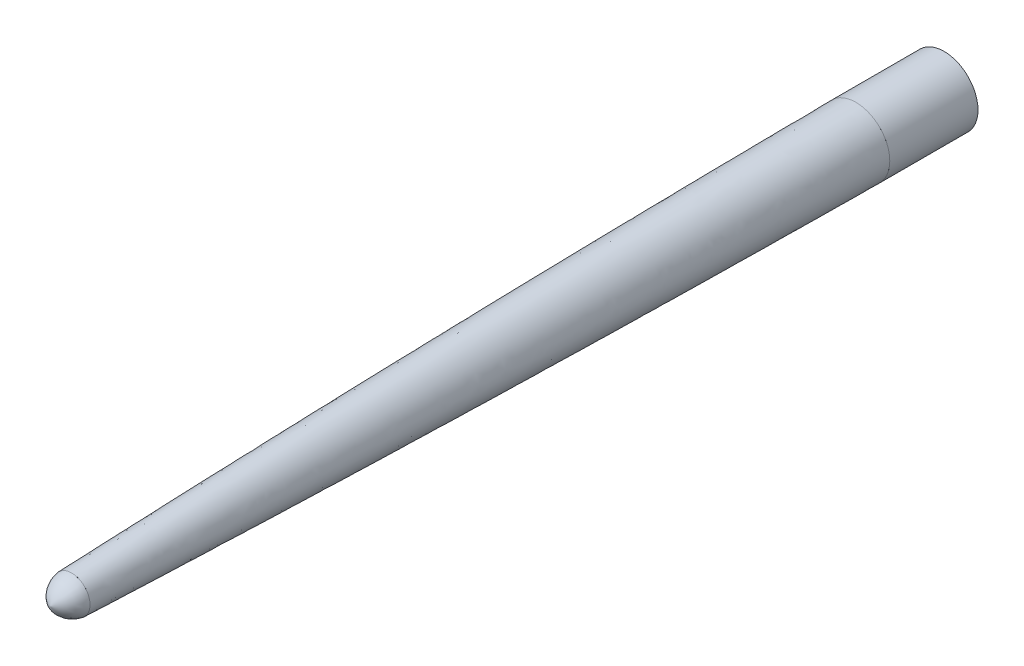
ISO-10303-21;
HEADER;
FILE_DESCRIPTION(('STEP AP214'),'2;1');
FILE_NAME('part.step','',(''),(''),'','','');
FILE_SCHEMA(('AUTOMOTIVE_DESIGN { 1 0 10303 214 1 1 1 1 }'));
ENDSEC;
DATA;
#1=APPLICATION_CONTEXT('core data for automotive mechanical design processes');
#2=APPLICATION_PROTOCOL_DEFINITION('international standard','automotive_design',2000,#1);
#3=PRODUCT_CONTEXT('',#1,'mechanical');
#4=PRODUCT('Part','Part','',(#3));
#5=PRODUCT_RELATED_PRODUCT_CATEGORY('part','',(#4));
#6=PRODUCT_DEFINITION_FORMATION('','',#4);
#7=PRODUCT_DEFINITION_CONTEXT('part definition',#1,'design');
#8=PRODUCT_DEFINITION('design','',#6,#7);
#9=PRODUCT_DEFINITION_SHAPE('','',#8);
#10=(LENGTH_UNIT() NAMED_UNIT(*) SI_UNIT(.MILLI.,.METRE.));
#11=(NAMED_UNIT(*) PLANE_ANGLE_UNIT() SI_UNIT($,.RADIAN.));
#12=(NAMED_UNIT(*) SI_UNIT($,.STERADIAN.) SOLID_ANGLE_UNIT());
#13=UNCERTAINTY_MEASURE_WITH_UNIT(LENGTH_MEASURE(1.E-05),#10,'distance_accuracy_value','');
#14=(GEOMETRIC_REPRESENTATION_CONTEXT(3) GLOBAL_UNCERTAINTY_ASSIGNED_CONTEXT((#13)) GLOBAL_UNIT_ASSIGNED_CONTEXT((#10,
#11,#12)) REPRESENTATION_CONTEXT('',''));
#15=CARTESIAN_POINT('',(0.,0.,0.));
#16=DIRECTION('',(0.,0.,1.));
#17=DIRECTION('',(1.,0.,0.));
#18=AXIS2_PLACEMENT_3D('',#15,#16,#17);
#19=CARTESIAN_POINT('',(0.,0.,123.6));
#20=DIRECTION('',(0.,0.,-1.));
#21=DIRECTION('',(-1.,0.,0.));
#22=AXIS2_PLACEMENT_3D('',#19,#20,#21);
#23=PLANE('',#22);
#24=CARTESIAN_POINT('',(0.,0.,123.6));
#25=DIRECTION('',(0.,0.,-1.));
#26=DIRECTION('',(-1.,0.,0.));
#27=AXIS2_PLACEMENT_3D('',#24,#25,#26);
#28=CIRCLE('',#27,2.6);
#29=CARTESIAN_POINT('',(-2.6,0.,123.6));
#30=VERTEX_POINT('',#29);
#31=EDGE_CURVE('E14',#30,#30,#28,.T.);
#32=ORIENTED_EDGE('',*,*,#31,.T.);
#33=EDGE_LOOP('',(#32));
#34=FACE_BOUND('',#33,.T.);
#35=ADVANCED_FACE('F120',(#34),#23,.T.);
#36=CARTESIAN_POINT('',(1.02046314070404,0.,123.088931944723));
#37=DIRECTION('',(0.,-1.,0.));
#38=DIRECTION('',(-1.,0.,0.));
#39=AXIS2_PLACEMENT_3D('',#36,#37,#38);
#40=CIRCLE('',#39,3.65635664430058);
#41=TRIMMED_CURVE('',#40,(PARAMETER_VALUE(-1.2879469943826)),(PARAMETER_VALUE(1.2879469943826)),
.T.,.PARAMETER.);
#42=CARTESIAN_POINT('',(0.,0.,123.088931944723));
#43=DIRECTION('',(0.,0.,-1.));
#44=AXIS1_PLACEMENT('',#42,#43);
#45=SURFACE_OF_REVOLUTION('',#41,#44);
#46=CARTESIAN_POINT('',(0.,0.,126.6));
#47=VERTEX_POINT('',#46);
#48=VERTEX_LOOP('',#47);
#49=FACE_BOUND('',#48,.T.);
#50=ORIENTED_EDGE('',*,*,#31,.F.);
#51=EDGE_LOOP('',(#50));
#52=FACE_BOUND('',#51,.T.);
#53=ADVANCED_FACE('F127',(#49,#52),#45,.T.);
#54=CLOSED_SHELL('',(#35,#53));
#55=MANIFOLD_SOLID_BREP('B2',#54);
#56=CARTESIAN_POINT('',(0.,0.,12.5));
#57=DIRECTION('',(0.,0.,1.));
#58=DIRECTION('',(1.,0.,0.));
#59=AXIS2_PLACEMENT_3D('',#56,#57,#58);
#60=PLANE('',#59);
#61=CARTESIAN_POINT('',(0.,0.,12.5));
#62=DIRECTION('',(0.,0.,1.));
#63=DIRECTION('',(1.,0.,0.));
#64=AXIS2_PLACEMENT_3D('',#61,#62,#63);
#65=CIRCLE('',#64,4.8);
#66=CARTESIAN_POINT('',(4.8,0.,12.5));
#67=VERTEX_POINT('',#66);
#68=EDGE_CURVE('E119',#67,#67,#65,.T.);
#69=ORIENTED_EDGE('',*,*,#68,.T.);
#70=EDGE_LOOP('',(#69));
#71=FACE_BOUND('',#70,.T.);
#72=ADVANCED_FACE('F156',(#71),#60,.T.);
#73=OPEN_SHELL('',(#72));
#74=SHELL_BASED_SURFACE_MODEL('B8',(#73));
#75=CARTESIAN_POINT('',(0.,-2.6,123.6));
#76=DIRECTION('',(0.,1.43645157507346E-12,-1.));
#77=DIRECTION('',(0.,1.,1.43645157507346E-12));
#78=AXIS2_PLACEMENT_3D('',#75,#76,#77);
#79=PLANE('',#78);
#80=CARTESIAN_POINT('',(0.,2.6,123.6));
#81=CARTESIAN_POINT('',(-0.340339201924438,2.6,123.6));
#82=CARTESIAN_POINT('',(-1.0209348103524,2.46474376673682,123.6));
#83=CARTESIAN_POINT('',(-1.88638582277971,1.88638582277971,123.6));
#84=CARTESIAN_POINT('',(-2.46474376673682,1.02093481035239,123.6));
#85=CARTESIAN_POINT('',(-2.6,0.340339201924438,123.6));
#86=CARTESIAN_POINT('',(-2.6,-0.340339201924438,123.6));
#87=CARTESIAN_POINT('',(-2.46474376673682,-1.02093481035239,123.6));
#88=CARTESIAN_POINT('',(-1.88638582277971,-1.88638582277971,123.6));
#89=CARTESIAN_POINT('',(-1.0209348103524,-2.46474376673681,123.6));
#90=CARTESIAN_POINT('',(-0.340339201924438,-2.6,123.6));
#91=CARTESIAN_POINT('',(0.340339201924438,-2.6,123.6));
#92=CARTESIAN_POINT('',(1.02093481035239,-2.46474376673681,123.6));
#93=CARTESIAN_POINT('',(1.88638582277971,-1.88638582277971,123.6));
#94=CARTESIAN_POINT('',(2.46474376673681,-1.02093481035239,123.6));
#95=CARTESIAN_POINT('',(2.6,-0.340339201924438,123.6));
#96=CARTESIAN_POINT('',(2.6,0.340339201924438,123.6));
#97=CARTESIAN_POINT('',(2.46474376673681,1.02093481035239,123.6));
#98=CARTESIAN_POINT('',(1.88638582277971,1.88638582277971,123.6));
#99=CARTESIAN_POINT('',(1.02093481035239,2.46474376673682,123.6));
#100=CARTESIAN_POINT('',(0.340339201924438,2.6,123.6));
#101=CARTESIAN_POINT('',(0.,2.6,123.6));
#102=B_SPLINE_CURVE_WITH_KNOTS('',3,(#80,#81,#82,#83,#84,#85,#86,#87,#88,#89,#90,#91,#92,#93,
#94,#95,#96,#97,#98,#99,#100,#101),.UNSPECIFIED.,.T.,.F.,(4,1,1,1,2,1,1,1,2,1,1,1,2,1,1,1,4),
(0.,0.0625,0.125,0.1875,0.25,0.3125,0.375,0.4375,0.5,0.5625,0.625,0.6875,0.75,0.8125,0.875,
0.9375,1.),.UNSPECIFIED.);
#103=CARTESIAN_POINT('',(0.,2.6,123.6));
#104=VERTEX_POINT('',#103);
#105=EDGE_CURVE('E155',#104,#104,#102,.F.);
#106=ORIENTED_EDGE('',*,*,#105,.F.);
#107=EDGE_LOOP('',(#106));
#108=FACE_BOUND('',#107,.T.);
#109=ADVANCED_FACE('F181',(#108),#79,.F.);
#110=OPEN_SHELL('',(#109));
#111=SHELL_BASED_SURFACE_MODEL('B114',(#110));
#112=CARTESIAN_POINT('',(0.,4.8,12.5));
#113=CARTESIAN_POINT('',(0.,4.75234807868441,49.7852241952484));
#114=CARTESIAN_POINT('',(0.,4.02844918502909,86.3421183248254));
#115=CARTESIAN_POINT('',(0.,2.6,123.6));
#116=CARTESIAN_POINT('',(-0.628318526629731,4.8,12.5));
#117=CARTESIAN_POINT('',(-0.532325418394634,4.75234807868441,49.7852241952484));
#118=CARTESIAN_POINT('',(-0.436332310159536,4.02844918502909,86.3421183248254));
#119=CARTESIAN_POINT('',(-0.340339201924438,2.6,123.6));
#120=CARTESIAN_POINT('',(-1.88474601557722,4.55035203243937,12.5));
#121=CARTESIAN_POINT('',(-1.68251912367105,4.45512051272071,49.7852241952481));
#122=CARTESIAN_POINT('',(-1.39576136022258,3.76817289220479,86.3421183248252));
#123=CARTESIAN_POINT('',(-1.0209348103524,2.46474376673682,123.6));
#124=CARTESIAN_POINT('',(-3.48255318879831,3.48255318879831,12.5));
#125=CARTESIAN_POINT('',(-3.29333810613387,3.29333810613431,49.7852241952477));
#126=CARTESIAN_POINT('',(-2.76599953730023,2.76599953730045,86.3421183248251));
#127=CARTESIAN_POINT('',(-1.88638582277971,1.88638582277971,123.6));
#128=CARTESIAN_POINT('',(-4.55035203243936,1.88474601557722,12.5));
#129=CARTESIAN_POINT('',(-4.45512051271993,1.68251912367116,49.7852241952469));
#130=CARTESIAN_POINT('',(-3.7681728922044,1.39576136022264,86.3421183248243));
#131=CARTESIAN_POINT('',(-2.46474376673682,1.02093481035239,123.6));
#132=CARTESIAN_POINT('',(-4.8,0.628318526629732,12.5));
#133=CARTESIAN_POINT('',(-4.75234807868352,0.532325418394634,49.7852241952468));
#134=CARTESIAN_POINT('',(-4.02844918502865,0.436332310159536,86.3421183248243));
#135=CARTESIAN_POINT('',(-2.6,0.340339201924438,123.6));
#136=CARTESIAN_POINT('',(-4.8,-0.628318526629731,12.5));
#137=CARTESIAN_POINT('',(-4.75234807868352,-0.532325418394634,49.7852241952468));
#138=CARTESIAN_POINT('',(-4.02844918502865,-0.436332310159536,86.3421183248243));
#139=CARTESIAN_POINT('',(-2.6,-0.340339201924438,123.6));
#140=CARTESIAN_POINT('',(-4.55035203243937,-1.88474601557722,12.5));
#141=CARTESIAN_POINT('',(-4.45512051271993,-1.68251912367116,49.785224195247));
#142=CARTESIAN_POINT('',(-3.7681728922044,-1.39576136022264,86.3421183248245));
#143=CARTESIAN_POINT('',(-2.46474376673682,-1.02093481035239,123.6));
#144=CARTESIAN_POINT('',(-3.4825531887983,-3.4825531887983,12.5));
#145=CARTESIAN_POINT('',(-3.29333810613387,-3.29333810613431,49.7852241952473));
#146=CARTESIAN_POINT('',(-2.76599953730023,-2.76599953730045,86.3421183248247));
#147=CARTESIAN_POINT('',(-1.88638582277971,-1.88638582277971,123.6));
#148=CARTESIAN_POINT('',(-1.88474601557722,-4.55035203243936,12.5));
#149=CARTESIAN_POINT('',(-1.68251912367105,-4.45512051272071,49.7852241952478));
#150=CARTESIAN_POINT('',(-1.39576136022258,-3.76817289220479,86.3421183248253));
#151=CARTESIAN_POINT('',(-1.0209348103524,-2.46474376673681,123.6));
#152=CARTESIAN_POINT('',(-0.628318526629733,-4.8,12.5));
#153=CARTESIAN_POINT('',(-0.532325418394634,-4.75234807868441,49.7852241952479));
#154=CARTESIAN_POINT('',(-0.436332310159536,-4.02844918502909,86.3421183248253));
#155=CARTESIAN_POINT('',(-0.340339201924438,-2.6,123.6));
#156=CARTESIAN_POINT('',(0.628318526629731,-4.8,12.5));
#157=CARTESIAN_POINT('',(0.532325418394634,-4.75234807868441,49.7852241952479));
#158=CARTESIAN_POINT('',(0.436332310159536,-4.02844918502909,86.3421183248253));
#159=CARTESIAN_POINT('',(0.340339201924438,-2.6,123.6));
#160=CARTESIAN_POINT('',(1.88474601557722,-4.55035203243937,12.5));
#161=CARTESIAN_POINT('',(1.68251912367105,-4.45512051272071,49.7852241952479));
#162=CARTESIAN_POINT('',(1.39576136022258,-3.76817289220479,86.3421183248253));
#163=CARTESIAN_POINT('',(1.02093481035239,-2.46474376673681,123.6));
#164=CARTESIAN_POINT('',(3.4825531887983,-3.4825531887983,12.5));
#165=CARTESIAN_POINT('',(3.29333810613387,-3.29333810613431,49.785224195248));
#166=CARTESIAN_POINT('',(2.76599953730024,-2.76599953730045,86.3421183248253));
#167=CARTESIAN_POINT('',(1.88638582277971,-1.88638582277971,123.6));
#168=CARTESIAN_POINT('',(4.55035203243937,-1.88474601557722,12.5));
#169=CARTESIAN_POINT('',(4.45512051271993,-1.68251912367116,49.785224195248));
#170=CARTESIAN_POINT('',(3.7681728922044,-1.39576136022264,86.3421183248251));
#171=CARTESIAN_POINT('',(2.46474376673681,-1.02093481035239,123.6));
#172=CARTESIAN_POINT('',(4.8,-0.628318526629732,12.5));
#173=CARTESIAN_POINT('',(4.75234807868352,-0.532325418394634,49.785224195248));
#174=CARTESIAN_POINT('',(4.02844918502865,-0.436332310159536,86.342118324825));
#175=CARTESIAN_POINT('',(2.6,-0.340339201924438,123.6));
#176=CARTESIAN_POINT('',(4.8,0.628318526629732,12.5));
#177=CARTESIAN_POINT('',(4.75234807868352,0.532325418394634,49.785224195248));
#178=CARTESIAN_POINT('',(4.02844918502865,0.436332310159536,86.342118324825));
#179=CARTESIAN_POINT('',(2.6,0.340339201924438,123.6));
#180=CARTESIAN_POINT('',(4.55035203243937,1.88474601557722,12.5));
#181=CARTESIAN_POINT('',(4.45512051271994,1.68251912367116,49.785224195248));
#182=CARTESIAN_POINT('',(3.7681728922044,1.39576136022264,86.342118324825));
#183=CARTESIAN_POINT('',(2.46474376673681,1.02093481035239,123.6));
#184=CARTESIAN_POINT('',(3.4825531887983,3.4825531887983,12.5));
#185=CARTESIAN_POINT('',(3.29333810613386,3.29333810613431,49.7852241952483));
#186=CARTESIAN_POINT('',(2.76599953730023,2.76599953730045,86.3421183248253));
#187=CARTESIAN_POINT('',(1.88638582277971,1.88638582277971,123.6));
#188=CARTESIAN_POINT('',(1.88474601557722,4.55035203243937,12.5));
#189=CARTESIAN_POINT('',(1.68251912367105,4.45512051272071,49.7852241952483));
#190=CARTESIAN_POINT('',(1.39576136022258,3.76817289220479,86.3421183248254));
#191=CARTESIAN_POINT('',(1.02093481035239,2.46474376673682,123.6));
#192=CARTESIAN_POINT('',(0.628318526629732,4.8,12.5));
#193=CARTESIAN_POINT('',(0.532325418394634,4.75234807868441,49.7852241952484));
#194=CARTESIAN_POINT('',(0.436332310159536,4.02844918502909,86.3421183248254));
#195=CARTESIAN_POINT('',(0.340339201924438,2.6,123.6));
#196=CARTESIAN_POINT('',(0.,4.8,12.5));
#197=CARTESIAN_POINT('',(0.,4.75234807868441,49.7852241952484));
#198=CARTESIAN_POINT('',(0.,4.02844918502909,86.3421183248254));
#199=CARTESIAN_POINT('',(0.,2.6,123.6));
#200=B_SPLINE_SURFACE_WITH_KNOTS('',3,3,((#112,#113,#114,#115),(#116,#117,#118,#119),(#120,#121,
#122,#123),(#124,#125,#126,#127),(#128,#129,#130,#131),(#132,#133,#134,#135),(#136,#137,#138,
#139),(#140,#141,#142,#143),(#144,#145,#146,#147),(#148,#149,#150,#151),(#152,#153,#154,#155),
(#156,#157,#158,#159),(#160,#161,#162,#163),(#164,#165,#166,#167),(#168,#169,#170,#171),(#172,
#173,#174,#175),(#176,#177,#178,#179),(#180,#181,#182,#183),(#184,#185,#186,#187),(#188,#189,
#190,#191),(#192,#193,#194,#195),(#196,#197,#198,#199)),.UNSPECIFIED.,.T.,.F.,.F.,(4,1,1,1,2,1,
1,1,2,1,1,1,2,1,1,1,4),(4,4),(0.,0.0625,0.125,0.1875,0.25,0.3125,0.375,0.4375,0.5,0.5625,0.625,
0.6875,0.75,0.8125,0.875,0.9375,1.),(0.,1.),.UNSPECIFIED.);
#201=CARTESIAN_POINT('',(0.,4.8,12.5));
#202=CARTESIAN_POINT('',(-0.628318526629731,4.8,12.5));
#203=CARTESIAN_POINT('',(-1.88474601557722,4.55035203243937,12.5));
#204=CARTESIAN_POINT('',(-3.48255318879831,3.48255318879831,12.5));
#205=CARTESIAN_POINT('',(-4.55035203243936,1.88474601557722,12.5));
#206=CARTESIAN_POINT('',(-4.8,0.628318526629732,12.5));
#207=CARTESIAN_POINT('',(-4.8,-0.628318526629731,12.5));
#208=CARTESIAN_POINT('',(-4.55035203243937,-1.88474601557722,12.5));
#209=CARTESIAN_POINT('',(-3.4825531887983,-3.4825531887983,12.5));
#210=CARTESIAN_POINT('',(-1.88474601557722,-4.55035203243936,12.5));
#211=CARTESIAN_POINT('',(-0.628318526629733,-4.8,12.5));
#212=CARTESIAN_POINT('',(0.628318526629731,-4.8,12.5));
#213=CARTESIAN_POINT('',(1.88474601557722,-4.55035203243937,12.5));
#214=CARTESIAN_POINT('',(3.4825531887983,-3.4825531887983,12.5));
#215=CARTESIAN_POINT('',(4.55035203243937,-1.88474601557722,12.5));
#216=CARTESIAN_POINT('',(4.8,-0.628318526629732,12.5));
#217=CARTESIAN_POINT('',(4.8,0.628318526629732,12.5));
#218=CARTESIAN_POINT('',(4.55035203243937,1.88474601557722,12.5));
#219=CARTESIAN_POINT('',(3.4825531887983,3.4825531887983,12.5));
#220=CARTESIAN_POINT('',(1.88474601557722,4.55035203243937,12.5));
#221=CARTESIAN_POINT('',(0.628318526629732,4.8,12.5));
#222=CARTESIAN_POINT('',(0.,4.8,12.5));
#223=B_SPLINE_CURVE_WITH_KNOTS('',3,(#201,#202,#203,#204,#205,#206,#207,#208,#209,#210,#211,
#212,#213,#214,#215,#216,#217,#218,#219,#220,#221,#222),.UNSPECIFIED.,.T.,.F.,(4,1,1,1,2,1,1,1,
2,1,1,1,2,1,1,1,4),(0.,0.0625,0.125,0.1875,0.25,0.3125,0.375,0.4375,0.5,0.5625,0.625,0.6875,
0.75,0.8125,0.875,0.9375,1.),.UNSPECIFIED.);
#224=CARTESIAN_POINT('',(0.,4.8,12.5));
#225=VERTEX_POINT('',#224);
#226=EDGE_CURVE('E180',#225,#225,#223,.T.);
#227=CARTESIAN_POINT('',(0.,2.6,123.6));
#228=CARTESIAN_POINT('',(-0.340339201924438,2.6,123.6));
#229=CARTESIAN_POINT('',(-1.0209348103524,2.46474376673682,123.6));
#230=CARTESIAN_POINT('',(-1.88638582277971,1.88638582277971,123.6));
#231=CARTESIAN_POINT('',(-2.46474376673682,1.02093481035239,123.6));
#232=CARTESIAN_POINT('',(-2.6,0.340339201924438,123.6));
#233=CARTESIAN_POINT('',(-2.6,-0.340339201924438,123.6));
#234=CARTESIAN_POINT('',(-2.46474376673682,-1.02093481035239,123.6));
#235=CARTESIAN_POINT('',(-1.88638582277971,-1.88638582277971,123.6));
#236=CARTESIAN_POINT('',(-1.0209348103524,-2.46474376673681,123.6));
#237=CARTESIAN_POINT('',(-0.340339201924438,-2.6,123.6));
#238=CARTESIAN_POINT('',(0.340339201924438,-2.6,123.6));
#239=CARTESIAN_POINT('',(1.02093481035239,-2.46474376673681,123.6));
#240=CARTESIAN_POINT('',(1.88638582277971,-1.88638582277971,123.6));
#241=CARTESIAN_POINT('',(2.46474376673681,-1.02093481035239,123.6));
#242=CARTESIAN_POINT('',(2.6,-0.340339201924438,123.6));
#243=CARTESIAN_POINT('',(2.6,0.340339201924438,123.6));
#244=CARTESIAN_POINT('',(2.46474376673681,1.02093481035239,123.6));
#245=CARTESIAN_POINT('',(1.88638582277971,1.88638582277971,123.6));
#246=CARTESIAN_POINT('',(1.02093481035239,2.46474376673682,123.6));
#247=CARTESIAN_POINT('',(0.340339201924438,2.6,123.6));
#248=CARTESIAN_POINT('',(0.,2.6,123.6));
#249=B_SPLINE_CURVE_WITH_KNOTS('',3,(#227,#228,#229,#230,#231,#232,#233,#234,#235,#236,#237,
#238,#239,#240,#241,#242,#243,#244,#245,#246,#247,#248),.UNSPECIFIED.,.T.,.F.,(4,1,1,1,2,1,1,1,
2,1,1,1,2,1,1,1,4),(0.,0.0625,0.125,0.1875,0.25,0.3125,0.375,0.4375,0.5,0.5625,0.625,0.6875,
0.75,0.8125,0.875,0.9375,1.),.UNSPECIFIED.);
#250=CARTESIAN_POINT('',(0.,2.6,123.6));
#251=VERTEX_POINT('',#250);
#252=EDGE_CURVE('E212',#251,#251,#249,.F.);
#253=ORIENTED_EDGE('',*,*,#226,.T.);
#254=EDGE_LOOP('',(#253));
#255=FACE_BOUND('',#254,.T.);
#256=ORIENTED_EDGE('',*,*,#252,.T.);
#257=EDGE_LOOP('',(#256));
#258=FACE_BOUND('',#257,.T.);
#259=ADVANCED_FACE('F209',(#255,#258),#200,.T.);
#260=OPEN_SHELL('',(#259));
#261=SHELL_BASED_SURFACE_MODEL('B150',(#260));
#262=CARTESIAN_POINT('',(0.,0.,12.5));
#263=DIRECTION('',(0.,0.,-1.));
#264=DIRECTION('',(-1.,0.,0.));
#265=AXIS2_PLACEMENT_3D('',#262,#263,#264);
#266=CYLINDRICAL_SURFACE('',#265,4.8);
#267=CARTESIAN_POINT('',(0.,0.,12.5));
#268=DIRECTION('',(0.,0.,1.));
#269=DIRECTION('',(1.,0.,0.));
#270=AXIS2_PLACEMENT_3D('',#267,#268,#269);
#271=CIRCLE('',#270,4.8);
#272=CARTESIAN_POINT('',(4.8,0.,12.5));
#273=VERTEX_POINT('',#272);
#274=EDGE_CURVE('E208',#273,#273,#271,.T.);
#275=ORIENTED_EDGE('',*,*,#274,.F.);
#276=EDGE_LOOP('',(#275));
#277=FACE_BOUND('',#276,.T.);
#278=CARTESIAN_POINT('',(0.,0.,0.));
#279=DIRECTION('',(0.,0.,1.));
#280=DIRECTION('',(1.,0.,0.));
#281=AXIS2_PLACEMENT_3D('',#278,#279,#280);
#282=CIRCLE('',#281,4.8);
#283=CARTESIAN_POINT('',(4.8,0.,0.));
#284=VERTEX_POINT('',#283);
#285=EDGE_CURVE('E253',#284,#284,#282,.T.);
#286=ORIENTED_EDGE('',*,*,#285,.T.);
#287=EDGE_LOOP('',(#286));
#288=FACE_BOUND('',#287,.T.);
#289=ADVANCED_FACE('F250',(#277,#288),#266,.T.);
#290=CARTESIAN_POINT('',(0.,0.,12.5));
#291=DIRECTION('',(0.,0.,1.));
#292=DIRECTION('',(1.,0.,0.));
#293=AXIS2_PLACEMENT_3D('',#290,#291,#292);
#294=PLANE('',#293);
#295=ORIENTED_EDGE('',*,*,#274,.T.);
#296=EDGE_LOOP('',(#295));
#297=FACE_BOUND('',#296,.T.);
#298=ADVANCED_FACE('F265',(#297),#294,.T.);
#299=CARTESIAN_POINT('',(0.,0.,0.));
#300=DIRECTION('',(0.,0.,1.));
#301=DIRECTION('',(1.,0.,0.));
#302=AXIS2_PLACEMENT_3D('',#299,#300,#301);
#303=PLANE('',#302);
#304=ORIENTED_EDGE('',*,*,#285,.F.);
#305=EDGE_LOOP('',(#304));
#306=FACE_BOUND('',#305,.T.);
#307=ADVANCED_FACE('F263',(#306),#303,.F.);
#308=CLOSED_SHELL('',(#289,#298,#307));
#309=MANIFOLD_SOLID_BREP('B175',#308);
#310=ADVANCED_BREP_SHAPE_REPRESENTATION('',(#18,#55,#309),#14);
#311=MANIFOLD_SURFACE_SHAPE_REPRESENTATION('',(#18,#74,#111,#261),#14);
#312=SHAPE_REPRESENTATION('',(#18),#14);
#313=SHAPE_DEFINITION_REPRESENTATION(#9,#312);
#314=SHAPE_REPRESENTATION_RELATIONSHIP('','',#312,#310);
#315=SHAPE_REPRESENTATION_RELATIONSHIP('','',#312,#311);
ENDSEC;
END-ISO-10303-21;
